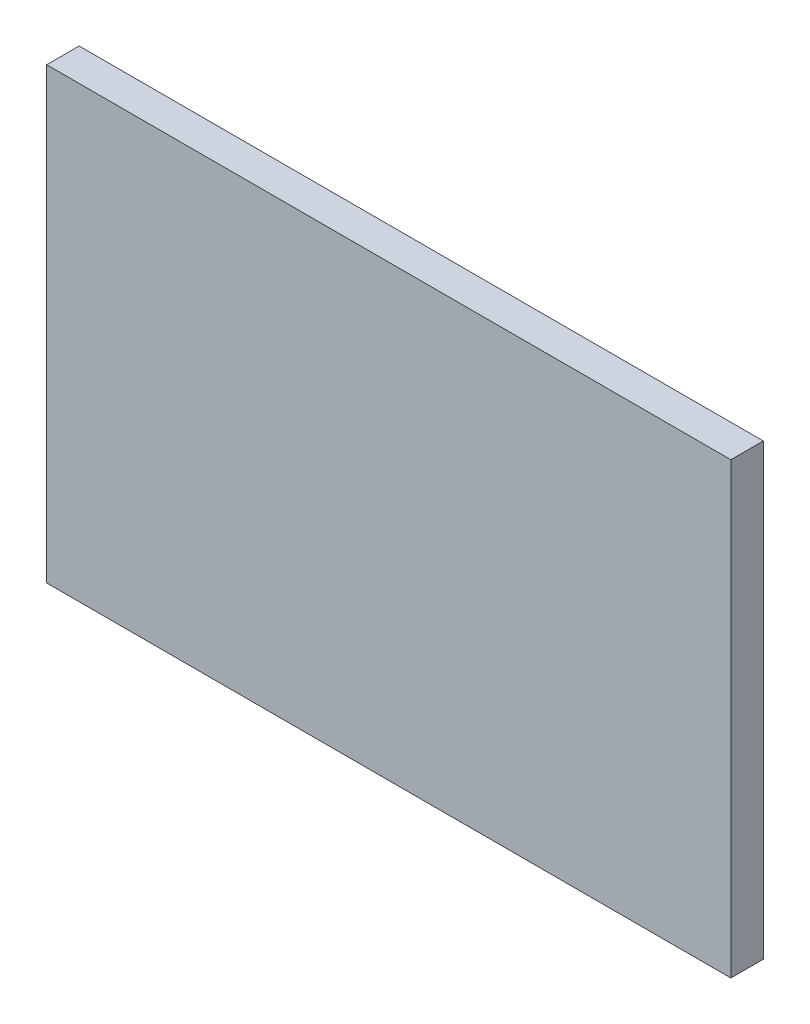
ISO-10303-21;
HEADER;
FILE_DESCRIPTION(('STEP AP214'),'2;1');
FILE_NAME('part.step','',(''),(''),'','','');
FILE_SCHEMA(('AUTOMOTIVE_DESIGN { 1 0 10303 214 1 1 1 1 }'));
ENDSEC;
DATA;
#1=APPLICATION_CONTEXT('core data for automotive mechanical design processes');
#2=APPLICATION_PROTOCOL_DEFINITION('international standard','automotive_design',2000,#1);
#3=PRODUCT_CONTEXT('',#1,'mechanical');
#4=PRODUCT('Part','Part','',(#3));
#5=PRODUCT_RELATED_PRODUCT_CATEGORY('part','',(#4));
#6=PRODUCT_DEFINITION_FORMATION('','',#4);
#7=PRODUCT_DEFINITION_CONTEXT('part definition',#1,'design');
#8=PRODUCT_DEFINITION('design','',#6,#7);
#9=PRODUCT_DEFINITION_SHAPE('','',#8);
#10=(LENGTH_UNIT() NAMED_UNIT(*) SI_UNIT(.MILLI.,.METRE.));
#11=(NAMED_UNIT(*) PLANE_ANGLE_UNIT() SI_UNIT($,.RADIAN.));
#12=(NAMED_UNIT(*) SI_UNIT($,.STERADIAN.) SOLID_ANGLE_UNIT());
#13=UNCERTAINTY_MEASURE_WITH_UNIT(LENGTH_MEASURE(1.E-05),#10,'distance_accuracy_value','');
#14=(GEOMETRIC_REPRESENTATION_CONTEXT(3) GLOBAL_UNCERTAINTY_ASSIGNED_CONTEXT((#13)) GLOBAL_UNIT_ASSIGNED_CONTEXT((#10,
#11,#12)) REPRESENTATION_CONTEXT('',''));
#15=CARTESIAN_POINT('',(0.,0.,0.));
#16=DIRECTION('',(0.,0.,1.));
#17=DIRECTION('',(1.,0.,0.));
#18=AXIS2_PLACEMENT_3D('',#15,#16,#17);
#19=CARTESIAN_POINT('',(-17.7,-16.75,3.24));
#20=DIRECTION('',(0.,0.,1.));
#21=DIRECTION('',(1.,0.,0.));
#22=AXIS2_PLACEMENT_3D('',#19,#20,#21);
#23=PLANE('',#22);
#24=DIRECTION('',(1.,0.,0.));
#25=VECTOR('',#24,1.);
#26=CARTESIAN_POINT('',(-26.35,-28.1,3.24));
#27=LINE('',#26,#25);
#28=CARTESIAN_POINT('',(-35.,-28.1,3.24));
#29=VERTEX_POINT('',#28);
#30=CARTESIAN_POINT('',(-0.399999999999994,-28.1,3.24));
#31=VERTEX_POINT('',#30);
#32=EDGE_CURVE('E21',#29,#31,#27,.T.);
#33=ORIENTED_EDGE('',*,*,#32,.T.);
#34=DIRECTION('',(0.,1.,0.));
#35=VECTOR('',#34,1.);
#36=CARTESIAN_POINT('',(-0.4,-16.75,3.24));
#37=LINE('',#36,#35);
#38=CARTESIAN_POINT('',(-0.4,-5.4,3.24));
#39=VERTEX_POINT('',#38);
#40=EDGE_CURVE('E107',#31,#39,#37,.T.);
#41=ORIENTED_EDGE('',*,*,#40,.T.);
#42=DIRECTION('',(-1.,0.,0.));
#43=VECTOR('',#42,1.);
#44=CARTESIAN_POINT('',(-17.7,-5.4,3.24));
#45=LINE('',#44,#43);
#46=CARTESIAN_POINT('',(-35.,-5.4,3.24));
#47=VERTEX_POINT('',#46);
#48=EDGE_CURVE('E76',#39,#47,#45,.T.);
#49=ORIENTED_EDGE('',*,*,#48,.T.);
#50=DIRECTION('',(0.,-1.,0.));
#51=VECTOR('',#50,1.);
#52=CARTESIAN_POINT('',(-35.,-16.75,3.24));
#53=LINE('',#52,#51);
#54=EDGE_CURVE('E11',#47,#29,#53,.T.);
#55=ORIENTED_EDGE('',*,*,#54,.T.);
#56=EDGE_LOOP('',(#33,#41,#49,#55));
#57=FACE_BOUND('',#56,.T.);
#58=ADVANCED_FACE('F17',(#57),#23,.T.);
#59=CARTESIAN_POINT('',(-17.7,-16.75,1.6));
#60=DIRECTION('',(0.,0.,1.));
#61=DIRECTION('',(1.,0.,0.));
#62=AXIS2_PLACEMENT_3D('',#59,#60,#61);
#63=PLANE('',#62);
#64=DIRECTION('',(1.,0.,0.));
#65=VECTOR('',#64,1.);
#66=CARTESIAN_POINT('',(-26.35,-28.1,1.6));
#67=LINE('',#66,#65);
#68=CARTESIAN_POINT('',(-35.,-28.1,1.6));
#69=VERTEX_POINT('',#68);
#70=CARTESIAN_POINT('',(-0.399999999999994,-28.1,1.6));
#71=VERTEX_POINT('',#70);
#72=EDGE_CURVE('E95',#69,#71,#67,.T.);
#73=ORIENTED_EDGE('',*,*,#72,.F.);
#74=DIRECTION('',(0.,-1.,0.));
#75=VECTOR('',#74,1.);
#76=CARTESIAN_POINT('',(-35.,-16.75,1.6));
#77=LINE('',#76,#75);
#78=CARTESIAN_POINT('',(-35.,-5.4,1.6));
#79=VERTEX_POINT('',#78);
#80=EDGE_CURVE('E28',#79,#69,#77,.T.);
#81=ORIENTED_EDGE('',*,*,#80,.F.);
#82=DIRECTION('',(-1.,0.,0.));
#83=VECTOR('',#82,1.);
#84=CARTESIAN_POINT('',(-17.7,-5.4,1.6));
#85=LINE('',#84,#83);
#86=CARTESIAN_POINT('',(-0.4,-5.4,1.6));
#87=VERTEX_POINT('',#86);
#88=EDGE_CURVE('E66',#87,#79,#85,.T.);
#89=ORIENTED_EDGE('',*,*,#88,.F.);
#90=DIRECTION('',(0.,1.,0.));
#91=VECTOR('',#90,1.);
#92=CARTESIAN_POINT('',(-0.4,-16.75,1.6));
#93=LINE('',#92,#91);
#94=EDGE_CURVE('E85',#71,#87,#93,.T.);
#95=ORIENTED_EDGE('',*,*,#94,.F.);
#96=EDGE_LOOP('',(#73,#81,#89,#95));
#97=FACE_BOUND('',#96,.T.);
#98=ADVANCED_FACE('F19',(#97),#63,.F.);
#99=CARTESIAN_POINT('',(-35.,-16.75,3.24));
#100=DIRECTION('',(1.,0.,0.));
#101=DIRECTION('',(0.,1.,0.));
#102=AXIS2_PLACEMENT_3D('',#99,#100,#101);
#103=PLANE('',#102);
#104=ORIENTED_EDGE('',*,*,#80,.T.);
#105=DIRECTION('',(0.,0.,-1.));
#106=VECTOR('',#105,1.);
#107=CARTESIAN_POINT('',(-35.,-28.1,3.24));
#108=LINE('',#107,#106);
#109=EDGE_CURVE('E79',#29,#69,#108,.T.);
#110=ORIENTED_EDGE('',*,*,#109,.F.);
#111=ORIENTED_EDGE('',*,*,#54,.F.);
#112=DIRECTION('',(0.,0.,-1.));
#113=VECTOR('',#112,1.);
#114=CARTESIAN_POINT('',(-35.,-5.4,3.24));
#115=LINE('',#114,#113);
#116=EDGE_CURVE('E109',#47,#79,#115,.T.);
#117=ORIENTED_EDGE('',*,*,#116,.T.);
#118=EDGE_LOOP('',(#104,#110,#111,#117));
#119=FACE_BOUND('',#118,.T.);
#120=ADVANCED_FACE('F80',(#119),#103,.F.);
#121=CARTESIAN_POINT('',(-17.7,-5.4,3.24));
#122=DIRECTION('',(0.,-1.,0.));
#123=DIRECTION('',(0.,0.,-1.));
#124=AXIS2_PLACEMENT_3D('',#121,#122,#123);
#125=PLANE('',#124);
#126=ORIENTED_EDGE('',*,*,#88,.T.);
#127=ORIENTED_EDGE('',*,*,#116,.F.);
#128=ORIENTED_EDGE('',*,*,#48,.F.);
#129=DIRECTION('',(0.,0.,-1.));
#130=VECTOR('',#129,1.);
#131=CARTESIAN_POINT('',(-0.4,-5.4,3.24));
#132=LINE('',#131,#130);
#133=EDGE_CURVE('E106',#39,#87,#132,.T.);
#134=ORIENTED_EDGE('',*,*,#133,.T.);
#135=EDGE_LOOP('',(#126,#127,#128,#134));
#136=FACE_BOUND('',#135,.T.);
#137=ADVANCED_FACE('F122',(#136),#125,.F.);
#138=CARTESIAN_POINT('',(-0.4,-16.75,3.24));
#139=DIRECTION('',(-1.,0.,0.));
#140=DIRECTION('',(0.,1.,0.));
#141=AXIS2_PLACEMENT_3D('',#138,#139,#140);
#142=PLANE('',#141);
#143=ORIENTED_EDGE('',*,*,#94,.T.);
#144=ORIENTED_EDGE('',*,*,#133,.F.);
#145=ORIENTED_EDGE('',*,*,#40,.F.);
#146=DIRECTION('',(0.,0.,-1.));
#147=VECTOR('',#146,1.);
#148=CARTESIAN_POINT('',(-0.399999999999994,-28.1,3.24));
#149=LINE('',#148,#147);
#150=EDGE_CURVE('E89',#31,#71,#149,.T.);
#151=ORIENTED_EDGE('',*,*,#150,.T.);
#152=EDGE_LOOP('',(#143,#144,#145,#151));
#153=FACE_BOUND('',#152,.T.);
#154=ADVANCED_FACE('F123',(#153),#142,.F.);
#155=CARTESIAN_POINT('',(-26.35,-28.1,3.24));
#156=DIRECTION('',(0.,1.,0.));
#157=DIRECTION('',(1.,0.,0.));
#158=AXIS2_PLACEMENT_3D('',#155,#156,#157);
#159=PLANE('',#158);
#160=ORIENTED_EDGE('',*,*,#72,.T.);
#161=ORIENTED_EDGE('',*,*,#150,.F.);
#162=ORIENTED_EDGE('',*,*,#32,.F.);
#163=ORIENTED_EDGE('',*,*,#109,.T.);
#164=EDGE_LOOP('',(#160,#161,#162,#163));
#165=FACE_BOUND('',#164,.T.);
#166=ADVANCED_FACE('F87',(#165),#159,.F.);
#167=CLOSED_SHELL('',(#58,#98,#120,#137,#154,#166));
#168=MANIFOLD_SOLID_BREP('B1',#167);
#169=ADVANCED_BREP_SHAPE_REPRESENTATION('',(#18,#168),#14);
#170=SHAPE_DEFINITION_REPRESENTATION(#9,#169);
ENDSEC;
END-ISO-10303-21;
